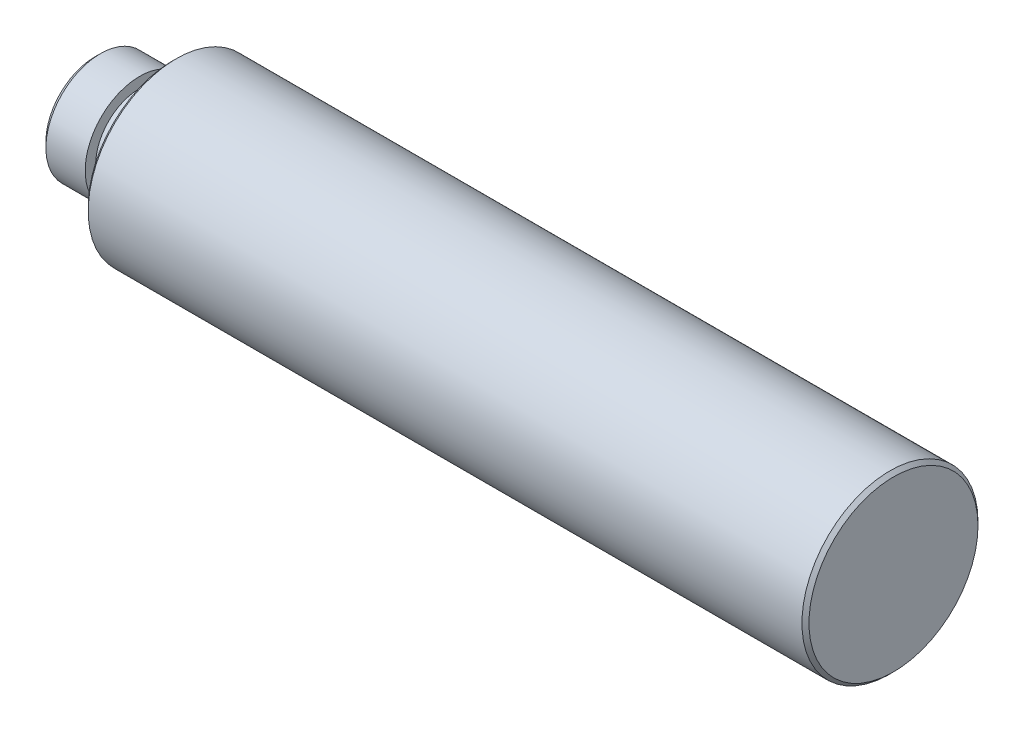
ISO-10303-21;
HEADER;
FILE_DESCRIPTION(('STEP AP214'),'2;1');
FILE_NAME('part.step','',(''),(''),'','','');
FILE_SCHEMA(('AUTOMOTIVE_DESIGN { 1 0 10303 214 1 1 1 1 }'));
ENDSEC;
DATA;
#1=APPLICATION_CONTEXT('core data for automotive mechanical design processes');
#2=APPLICATION_PROTOCOL_DEFINITION('international standard','automotive_design',2000,#1);
#3=PRODUCT_CONTEXT('',#1,'mechanical');
#4=PRODUCT('Part','Part','',(#3));
#5=PRODUCT_RELATED_PRODUCT_CATEGORY('part','',(#4));
#6=PRODUCT_DEFINITION_FORMATION('','',#4);
#7=PRODUCT_DEFINITION_CONTEXT('part definition',#1,'design');
#8=PRODUCT_DEFINITION('design','',#6,#7);
#9=PRODUCT_DEFINITION_SHAPE('','',#8);
#10=(LENGTH_UNIT() NAMED_UNIT(*) SI_UNIT(.MILLI.,.METRE.));
#11=(NAMED_UNIT(*) PLANE_ANGLE_UNIT() SI_UNIT($,.RADIAN.));
#12=(NAMED_UNIT(*) SI_UNIT($,.STERADIAN.) SOLID_ANGLE_UNIT());
#13=UNCERTAINTY_MEASURE_WITH_UNIT(LENGTH_MEASURE(1.E-05),#10,'distance_accuracy_value','');
#14=(GEOMETRIC_REPRESENTATION_CONTEXT(3) GLOBAL_UNCERTAINTY_ASSIGNED_CONTEXT((#13)) GLOBAL_UNIT_ASSIGNED_CONTEXT((#10,
#11,#12)) REPRESENTATION_CONTEXT('',''));
#15=CARTESIAN_POINT('',(0.,0.,0.));
#16=DIRECTION('',(0.,0.,1.));
#17=DIRECTION('',(1.,0.,0.));
#18=AXIS2_PLACEMENT_3D('',#15,#16,#17);
#19=CARTESIAN_POINT('',(-3.,4.953,0.));
#20=DIRECTION('',(-1.,0.,0.));
#21=DIRECTION('',(0.,0.,1.));
#22=AXIS2_PLACEMENT_3D('',#19,#20,#21);
#23=PLANE('',#22);
#24=CARTESIAN_POINT('',(-3.,0.,0.));
#25=DIRECTION('',(1.,0.,0.));
#26=DIRECTION('',(0.,0.,-1.));
#27=AXIS2_PLACEMENT_3D('',#24,#25,#26);
#28=CIRCLE('',#27,4.953);
#29=CARTESIAN_POINT('',(-3.,0.,-4.953));
#30=VERTEX_POINT('',#29);
#31=EDGE_CURVE('E11',#30,#30,#28,.T.);
#32=ORIENTED_EDGE('',*,*,#31,.T.);
#33=EDGE_LOOP('',(#32));
#34=FACE_BOUND('',#33,.T.);
#35=CARTESIAN_POINT('',(-3.,0.,0.));
#36=DIRECTION('',(1.,0.,0.));
#37=DIRECTION('',(0.,0.,-1.));
#38=AXIS2_PLACEMENT_3D('',#35,#36,#37);
#39=CIRCLE('',#38,4.);
#40=CARTESIAN_POINT('',(-3.,0.,-4.));
#41=VERTEX_POINT('',#40);
#42=EDGE_CURVE('E86',#41,#41,#39,.T.);
#43=ORIENTED_EDGE('',*,*,#42,.F.);
#44=EDGE_LOOP('',(#43));
#45=FACE_BOUND('',#44,.T.);
#46=ADVANCED_FACE('F16',(#34,#45),#23,.F.);
#47=CARTESIAN_POINT('',(17.,0.,0.));
#48=DIRECTION('',(1.,0.,0.));
#49=DIRECTION('',(0.,0.,-1.));
#50=AXIS2_PLACEMENT_3D('',#47,#48,#49);
#51=CYLINDRICAL_SURFACE('',#50,4.953);
#52=CARTESIAN_POINT('',(-6.5687,0.,0.));
#53=DIRECTION('',(1.,0.,0.));
#54=DIRECTION('',(0.,0.,-1.));
#55=AXIS2_PLACEMENT_3D('',#52,#53,#54);
#56=CIRCLE('',#55,4.953);
#57=CARTESIAN_POINT('',(-6.5687,0.,-4.953));
#58=VERTEX_POINT('',#57);
#59=EDGE_CURVE('E27',#58,#58,#56,.T.);
#60=ORIENTED_EDGE('',*,*,#59,.T.);
#61=EDGE_LOOP('',(#60));
#62=FACE_BOUND('',#61,.T.);
#63=ORIENTED_EDGE('',*,*,#31,.F.);
#64=EDGE_LOOP('',(#63));
#65=FACE_BOUND('',#64,.T.);
#66=ADVANCED_FACE('F112',(#62,#65),#51,.T.);
#67=CARTESIAN_POINT('',(-7.064,0.,0.));
#68=DIRECTION('',(1.,0.,0.));
#69=DIRECTION('',(0.,0.,-1.));
#70=AXIS2_PLACEMENT_3D('',#67,#68,#69);
#71=CONICAL_SURFACE('',#70,4.4577,0.785398163397448);
#72=CARTESIAN_POINT('',(-7.064,0.,0.));
#73=DIRECTION('',(1.,0.,0.));
#74=DIRECTION('',(0.,0.,-1.));
#75=AXIS2_PLACEMENT_3D('',#72,#73,#74);
#76=CIRCLE('',#75,4.4577);
#77=CARTESIAN_POINT('',(-7.064,0.,-4.4577));
#78=VERTEX_POINT('',#77);
#79=EDGE_CURVE('E88',#78,#78,#76,.T.);
#80=ORIENTED_EDGE('',*,*,#79,.T.);
#81=EDGE_LOOP('',(#80));
#82=FACE_BOUND('',#81,.T.);
#83=ORIENTED_EDGE('',*,*,#59,.F.);
#84=EDGE_LOOP('',(#83));
#85=FACE_BOUND('',#84,.T.);
#86=ADVANCED_FACE('F99',(#82,#85),#71,.T.);
#87=CARTESIAN_POINT('',(-7.064,0.,0.));
#88=DIRECTION('',(1.,0.,0.));
#89=DIRECTION('',(0.,1.,0.));
#90=AXIS2_PLACEMENT_3D('',#87,#88,#89);
#91=PLANE('',#90);
#92=ORIENTED_EDGE('',*,*,#79,.F.);
#93=EDGE_LOOP('',(#92));
#94=FACE_BOUND('',#93,.T.);
#95=ADVANCED_FACE('F102',(#94),#91,.F.);
#96=CARTESIAN_POINT('',(17.,0.,0.));
#97=DIRECTION('',(1.,0.,0.));
#98=DIRECTION('',(0.,0.,-1.));
#99=AXIS2_PLACEMENT_3D('',#96,#97,#98);
#100=CYLINDRICAL_SURFACE('',#99,4.);
#101=ORIENTED_EDGE('',*,*,#42,.T.);
#102=EDGE_LOOP('',(#101));
#103=FACE_BOUND('',#102,.T.);
#104=CARTESIAN_POINT('',(0.,0.,0.));
#105=DIRECTION('',(-1.,0.,0.));
#106=DIRECTION('',(0.,0.,-1.));
#107=AXIS2_PLACEMENT_3D('',#104,#105,#106);
#108=CIRCLE('',#107,4.);
#109=CARTESIAN_POINT('',(0.,0.,-4.));
#110=VERTEX_POINT('',#109);
#111=EDGE_CURVE('E72',#110,#110,#108,.T.);
#112=ORIENTED_EDGE('',*,*,#111,.T.);
#113=EDGE_LOOP('',(#112));
#114=FACE_BOUND('',#113,.T.);
#115=ADVANCED_FACE('F18',(#103,#114),#100,.T.);
#116=CARTESIAN_POINT('',(65.5,7.68,0.));
#117=DIRECTION('',(-1.,0.,0.));
#118=DIRECTION('',(0.,0.,1.));
#119=AXIS2_PLACEMENT_3D('',#116,#117,#118);
#120=PLANE('',#119);
#121=CARTESIAN_POINT('',(65.5,0.,0.));
#122=DIRECTION('',(1.,0.,0.));
#123=DIRECTION('',(0.,0.,-1.));
#124=AXIS2_PLACEMENT_3D('',#121,#122,#123);
#125=CIRCLE('',#124,7.68);
#126=CARTESIAN_POINT('',(65.5,0.,-7.68));
#127=VERTEX_POINT('',#126);
#128=EDGE_CURVE('E20',#127,#127,#125,.T.);
#129=ORIENTED_EDGE('',*,*,#128,.T.);
#130=EDGE_LOOP('',(#129));
#131=FACE_BOUND('',#130,.T.);
#132=ADVANCED_FACE('F110',(#131),#120,.F.);
#133=CARTESIAN_POINT('',(65.18,0.,0.));
#134=DIRECTION('',(-1.,0.,0.));
#135=DIRECTION('',(0.,0.,1.));
#136=AXIS2_PLACEMENT_3D('',#133,#134,#135);
#137=CONICAL_SURFACE('',#136,8.,0.785398163397447);
#138=CARTESIAN_POINT('',(65.18,0.,0.));
#139=DIRECTION('',(1.,0.,0.));
#140=DIRECTION('',(0.,0.,-1.));
#141=AXIS2_PLACEMENT_3D('',#138,#139,#140);
#142=CIRCLE('',#141,8.);
#143=CARTESIAN_POINT('',(65.18,0.,-8.));
#144=VERTEX_POINT('',#143);
#145=EDGE_CURVE('E82',#144,#144,#142,.T.);
#146=ORIENTED_EDGE('',*,*,#145,.T.);
#147=EDGE_LOOP('',(#146));
#148=FACE_BOUND('',#147,.T.);
#149=ORIENTED_EDGE('',*,*,#128,.F.);
#150=EDGE_LOOP('',(#149));
#151=FACE_BOUND('',#150,.T.);
#152=ADVANCED_FACE('F123',(#148,#151),#137,.T.);
#153=CARTESIAN_POINT('',(65.5,0.,0.));
#154=DIRECTION('',(1.,0.,0.));
#155=DIRECTION('',(0.,0.,-1.));
#156=AXIS2_PLACEMENT_3D('',#153,#154,#155);
#157=CYLINDRICAL_SURFACE('',#156,8.);
#158=CARTESIAN_POINT('',(0.32,0.,0.));
#159=DIRECTION('',(1.,0.,0.));
#160=DIRECTION('',(0.,0.,-1.));
#161=AXIS2_PLACEMENT_3D('',#158,#159,#160);
#162=CIRCLE('',#161,8.);
#163=CARTESIAN_POINT('',(0.32,0.,-8.));
#164=VERTEX_POINT('',#163);
#165=EDGE_CURVE('E75',#164,#164,#162,.T.);
#166=ORIENTED_EDGE('',*,*,#165,.T.);
#167=EDGE_LOOP('',(#166));
#168=FACE_BOUND('',#167,.T.);
#169=ORIENTED_EDGE('',*,*,#145,.F.);
#170=EDGE_LOOP('',(#169));
#171=FACE_BOUND('',#170,.T.);
#172=ADVANCED_FACE('F125',(#168,#171),#157,.T.);
#173=CARTESIAN_POINT('',(0.,0.,0.));
#174=DIRECTION('',(1.,0.,0.));
#175=DIRECTION('',(0.,0.,-1.));
#176=AXIS2_PLACEMENT_3D('',#173,#174,#175);
#177=CONICAL_SURFACE('',#176,7.68,0.785398163397447);
#178=CARTESIAN_POINT('',(0.,0.,0.));
#179=DIRECTION('',(1.,0.,0.));
#180=DIRECTION('',(0.,0.,-1.));
#181=AXIS2_PLACEMENT_3D('',#178,#179,#180);
#182=CIRCLE('',#181,7.68);
#183=CARTESIAN_POINT('',(0.,0.,-7.68));
#184=VERTEX_POINT('',#183);
#185=EDGE_CURVE('E66',#184,#184,#182,.T.);
#186=ORIENTED_EDGE('',*,*,#185,.T.);
#187=EDGE_LOOP('',(#186));
#188=FACE_BOUND('',#187,.T.);
#189=ORIENTED_EDGE('',*,*,#165,.F.);
#190=EDGE_LOOP('',(#189));
#191=FACE_BOUND('',#190,.T.);
#192=ADVANCED_FACE('F164',(#188,#191),#177,.T.);
#193=CARTESIAN_POINT('',(0.,0.,0.));
#194=DIRECTION('',(1.,0.,0.));
#195=DIRECTION('',(0.,1.,0.));
#196=AXIS2_PLACEMENT_3D('',#193,#194,#195);
#197=PLANE('',#196);
#198=ORIENTED_EDGE('',*,*,#111,.F.);
#199=EDGE_LOOP('',(#198));
#200=FACE_BOUND('',#199,.T.);
#201=ORIENTED_EDGE('',*,*,#185,.F.);
#202=EDGE_LOOP('',(#201));
#203=FACE_BOUND('',#202,.T.);
#204=ADVANCED_FACE('F156',(#200,#203),#197,.F.);
#205=CLOSED_SHELL('',(#46,#66,#86,#95,#115,#132,#152,#172,#192,#204));
#206=MANIFOLD_SOLID_BREP('B1',#205);
#207=ADVANCED_BREP_SHAPE_REPRESENTATION('',(#18,#206),#14);
#208=SHAPE_DEFINITION_REPRESENTATION(#9,#207);
ENDSEC;
END-ISO-10303-21;
